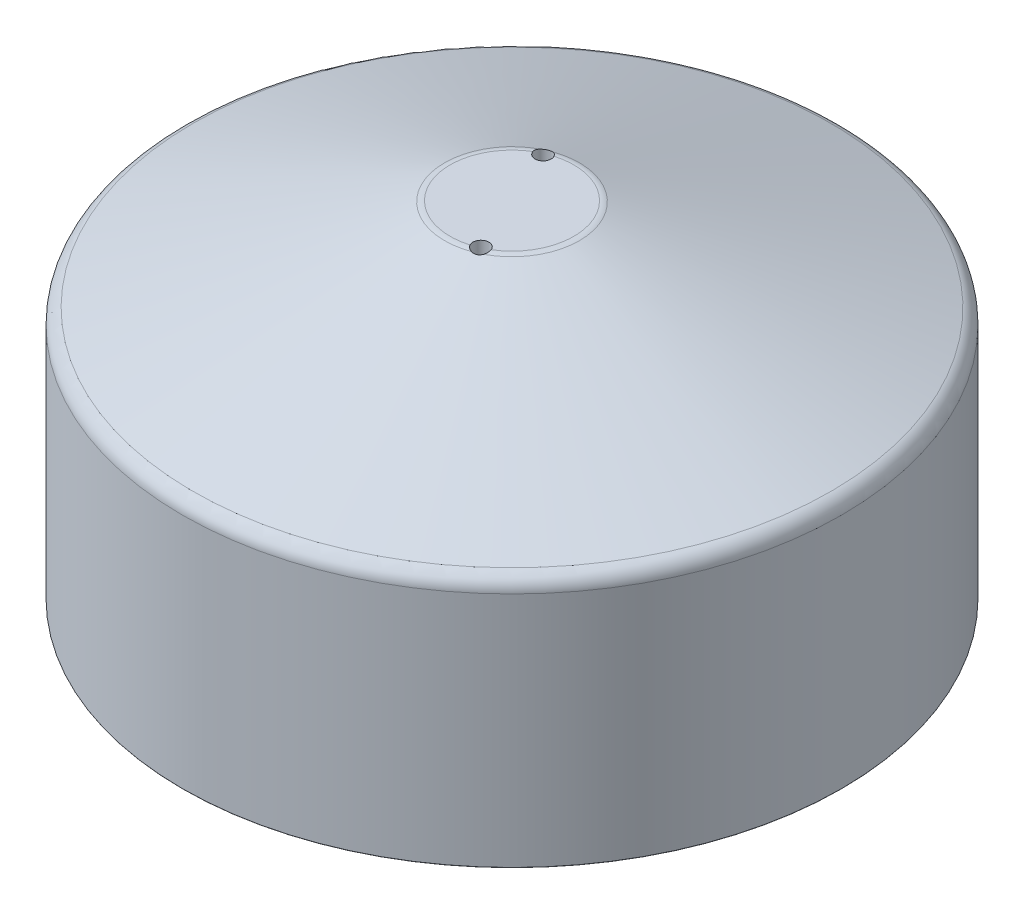
ISO-10303-21;
HEADER;
FILE_DESCRIPTION(('STEP AP214'),'2;1');
FILE_NAME('part.step','',(''),(''),'','','');
FILE_SCHEMA(('AUTOMOTIVE_DESIGN { 1 0 10303 214 1 1 1 1 }'));
ENDSEC;
DATA;
#1=APPLICATION_CONTEXT('core data for automotive mechanical design processes');
#2=APPLICATION_PROTOCOL_DEFINITION('international standard','automotive_design',2000,#1);
#3=PRODUCT_CONTEXT('',#1,'mechanical');
#4=PRODUCT('Part','Part','',(#3));
#5=PRODUCT_RELATED_PRODUCT_CATEGORY('part','',(#4));
#6=PRODUCT_DEFINITION_FORMATION('','',#4);
#7=PRODUCT_DEFINITION_CONTEXT('part definition',#1,'design');
#8=PRODUCT_DEFINITION('design','',#6,#7);
#9=PRODUCT_DEFINITION_SHAPE('','',#8);
#10=(LENGTH_UNIT() NAMED_UNIT(*) SI_UNIT(.MILLI.,.METRE.));
#11=(NAMED_UNIT(*) PLANE_ANGLE_UNIT() SI_UNIT($,.RADIAN.));
#12=(NAMED_UNIT(*) SI_UNIT($,.STERADIAN.) SOLID_ANGLE_UNIT());
#13=UNCERTAINTY_MEASURE_WITH_UNIT(LENGTH_MEASURE(1.E-05),#10,'distance_accuracy_value','');
#14=(GEOMETRIC_REPRESENTATION_CONTEXT(3) GLOBAL_UNCERTAINTY_ASSIGNED_CONTEXT((#13)) GLOBAL_UNIT_ASSIGNED_CONTEXT((#10,
#11,#12)) REPRESENTATION_CONTEXT('',''));
#15=CARTESIAN_POINT('',(0.,0.,0.));
#16=DIRECTION('',(0.,0.,1.));
#17=DIRECTION('',(1.,0.,0.));
#18=AXIS2_PLACEMENT_3D('',#15,#16,#17);
#19=CARTESIAN_POINT('',(0.,24.5121599294206,0.));
#20=DIRECTION('',(0.,-1.,0.));
#21=DIRECTION('',(1.,0.,0.));
#22=AXIS2_PLACEMENT_3D('',#19,#20,#21);
#23=TOROIDAL_SURFACE('',#22,9.7121294690005,2.54);
#24=CARTESIAN_POINT('',(3.16289406880196,26.608133655374,7.64926071069205));
#25=CARTESIAN_POINT('',(3.1122658398592,26.6150586853284,7.68121068737127));
#26=CARTESIAN_POINT('',(3.06443283132598,26.6252204259069,7.71646384288699));
#27=CARTESIAN_POINT('',(2.97505496815367,26.6503008396763,7.79238201545961));
#28=CARTESIAN_POINT('',(2.93348041294001,26.6651959289582,7.8330196312678));
#29=CARTESIAN_POINT('',(2.84531334262754,26.7030655357985,7.9317166127905));
#30=CARTESIAN_POINT('',(2.80095581869567,26.7271233810238,7.9913455828255));
#31=CARTESIAN_POINT('',(2.72343895794779,26.7771996032094,8.11694727354901));
#32=CARTESIAN_POINT('',(2.69031374359375,26.8032236656262,8.18293855600871));
#33=CARTESIAN_POINT('',(2.6359367967409,26.8543258632034,8.31992606584156));
#34=CARTESIAN_POINT('',(2.61467340471618,26.8794049045714,8.39091730093301));
#35=CARTESIAN_POINT('',(2.58480974293635,26.9262135219288,8.53652295254289));
#36=CARTESIAN_POINT('',(2.57619232664354,26.9479475974389,8.61113232112151));
#37=CARTESIAN_POINT('',(2.57253061834088,26.9855881606593,8.76001790083851));
#38=CARTESIAN_POINT('',(2.57712171698754,27.0016377152733,8.834247462846));
#39=CARTESIAN_POINT('',(2.59961137713561,27.0273921163017,8.98179260155693));
#40=CARTESIAN_POINT('',(2.6174999002007,27.0371017384508,9.05510882532504));
#41=CARTESIAN_POINT('',(2.66329949463086,27.0488961840598,9.18909731758884));
#42=CARTESIAN_POINT('',(2.68971198258453,27.0517702072018,9.25021738789718));
#43=CARTESIAN_POINT('',(2.75182788101547,27.0524748955089,9.36755903023198));
#44=CARTESIAN_POINT('',(2.78753003540517,27.0503062421971,9.42378126314098));
#45=CARTESIAN_POINT('',(2.86580846246229,27.0417530555912,9.52797784325945));
#46=CARTESIAN_POINT('',(2.90812456156652,27.035507380779,9.576160388801));
#47=CARTESIAN_POINT('',(2.99923019896101,27.0198456807298,9.66534036899426));
#48=CARTESIAN_POINT('',(3.04802103776636,27.0104290179829,9.70633635630541));
#49=CARTESIAN_POINT('',(3.15416388402147,26.9888119330638,9.78272647730266));
#50=CARTESIAN_POINT('',(3.21186305941604,26.9764725305028,9.81759834694446));
#51=CARTESIAN_POINT('',(3.3318827609153,26.9507450478181,9.87769333545068));
#52=CARTESIAN_POINT('',(3.39420547153777,26.9373564718128,9.90291185821355));
#53=CARTESIAN_POINT('',(3.52657908028919,26.9099867152059,9.94458003131547));
#54=CARTESIAN_POINT('',(3.59686616706889,26.8960288631206,9.96029994087542));
#55=CARTESIAN_POINT('',(3.73946962655608,26.8701473271584,9.97959361524868));
#56=CARTESIAN_POINT('',(3.81178592843163,26.8582235723818,9.98316780349101));
#57=CARTESIAN_POINT('',(3.95580914345715,26.8380322803022,9.97785824840209));
#58=CARTESIAN_POINT('',(4.02751541062143,26.8297314997902,9.9690910351428));
#59=CARTESIAN_POINT('',(4.16872426173695,26.817784186049,9.93933242711084));
#60=CARTESIAN_POINT('',(4.23822846024381,26.814134162091,9.91835021782964));
#61=CARTESIAN_POINT('',(4.3679564638612,26.8120899279083,9.86665001586244));
#62=CARTESIAN_POINT('',(4.42848928555071,26.8133452759574,9.83671746257757));
#63=CARTESIAN_POINT('',(4.54387791072335,26.8201690211535,9.76771128184184));
#64=CARTESIAN_POINT('',(4.59873016405357,26.8257400972547,9.72863198714199));
#65=CARTESIAN_POINT('',(4.70050655451266,26.840389479796,9.64321609131596));
#66=CARTESIAN_POINT('',(4.74753373160007,26.8494159828439,9.59699242818031));
#67=CARTESIAN_POINT('',(4.8335449230131,26.86995433383,9.498211061696));
#68=CARTESIAN_POINT('',(4.87254661964698,26.8814606010361,9.44566769635553));
#69=CARTESIAN_POINT('',(4.91205475828657,26.8953161294943,9.38287689941204));
#70=CARTESIAN_POINT('',(4.91685215505758,26.8970418001206,9.37506440732288));
#71=CARTESIAN_POINT('',(4.95826247360037,26.9123117486965,9.30594883474743));
#72=CARTESIAN_POINT('',(4.9897552854179,26.9265550779419,9.24158186230228));
#73=CARTESIAN_POINT('',(5.04151591053406,26.9547961714071,9.10827588250529));
#74=CARTESIAN_POINT('',(5.06175013740609,26.9687930815164,9.03932387485705));
#75=CARTESIAN_POINT('',(5.09030623101168,26.9948590383268,8.89854596919463));
#76=CARTESIAN_POINT('',(5.0986187971096,27.00692657332,8.82671787226434));
#77=CARTESIAN_POINT('',(5.10281766019221,27.0274935969082,8.68223764287779));
#78=CARTESIAN_POINT('',(5.09871757618119,27.0359969843832,8.60958650062063));
#79=CARTESIAN_POINT('',(5.07843067906742,27.0477766632143,8.46869708555595));
#80=CARTESIAN_POINT('',(5.06276271590201,27.0512589345501,8.40040217652547));
#81=CARTESIAN_POINT('',(5.02031880004396,27.0527521620874,8.26729963497546));
#82=CARTESIAN_POINT('',(4.99354834850747,27.0507658251774,8.20249029333778));
#83=CARTESIAN_POINT('',(4.93228049007016,27.041334343956,8.08315498556849));
#84=CARTESIAN_POINT('',(4.89850511361658,27.0343058193046,8.02822273662619));
#85=CARTESIAN_POINT('',(4.82347070016159,27.0154678346228,7.92463345436288));
#86=CARTESIAN_POINT('',(4.78220949269366,27.0036569867632,7.87597824804763));
#87=CARTESIAN_POINT('',(4.69835273251267,26.9774111744399,7.79082721034411));
#88=CARTESIAN_POINT('',(4.65637267766448,26.963392376732,7.75358732376901));
#89=CARTESIAN_POINT('',(4.5685275946833,26.9327878116325,7.68540734398158));
#90=CARTESIAN_POINT('',(4.52266978634248,26.9162067691012,7.65445589310155));
#91=CARTESIAN_POINT('',(4.47254500622513,26.8977631333309,7.62515524062943));
#92=CARTESIAN_POINT('',(4.46977853346077,26.896744203007,7.6235521766016));
#93=CARTESIAN_POINT('',(4.40825025759456,26.8740615903082,7.58821053835535));
#94=CARTESIAN_POINT('',(4.34704040984042,26.8510742544181,7.55934715316281));
#95=CARTESIAN_POINT('',(4.22097247682139,26.804325473761,7.51171984584249));
#96=CARTESIAN_POINT('',(4.15610444968005,26.7805620013963,7.49298507100336));
#97=CARTESIAN_POINT('',(4.01655926176851,26.7319599192164,7.46456164663566));
#98=CARTESIAN_POINT('',(3.9415741090133,26.707277262744,7.4560519232396));
#99=CARTESIAN_POINT('',(3.78976948882654,26.6631943602675,7.45268681885608));
#100=CARTESIAN_POINT('',(3.71294877318139,26.6437978269233,7.45784100747546));
#101=CARTESIAN_POINT('',(3.63602503419644,26.6288571092347,7.47023915526866));
#102=B_SPLINE_CURVE_WITH_KNOTS('',3,(#24,#25,#26,#27,#28,#29,#30,#31,#32,#33,#34,#35,#36,#37,
#38,#39,#40,#41,#42,#43,#44,#45,#46,#47,#48,#49,#50,#51,#52,#53,#54,#55,#56,#57,#58,#59,#60,#61,
#62,#63,#64,#65,#66,#67,#68,#69,#70,#71,#72,#73,#74,#75,#76,#77,#78,#79,#80,#81,#82,#83,#84,#85,
#86,#87,#88,#89,#90,#91,#92,#93,#94,#95,#96,#97,#98,#99,#100,#101),.UNSPECIFIED.,.F.,.F.,(4,2,2,
2,2,2,2,2,2,2,2,2,2,2,2,2,2,2,2,2,2,2,2,2,2,2,2,2,2,2,2,2,2,2,2,2,2,2,4),(0.,0.180226990449717,
0.359569719874043,0.592703288807219,0.826538875172114,1.06014420704812,1.29343250245942,
1.52034338256523,1.74708313779571,1.94600979417155,2.14490956695911,2.33736556216033,
2.52986027271605,2.73460047676433,2.93943803977046,3.15848664721944,3.37752761802926,
3.59451417639499,3.81133777454986,4.01296453217495,4.21471654841166,4.41355541177789,
4.61195137425204,4.63994011214079,4.8579453931973,5.07659758421792,5.29542026324725,
5.51400293981774,5.72333526108643,5.93256398426677,6.12624466005431,6.31998158226304,
6.49298249115747,6.66566810626562,6.67573592340066,6.88914224543848,7.10315946535491,
7.34001906914286,7.57704460286264),.UNSPECIFIED.);
#103=CARTESIAN_POINT('',(2.72742769422414,27.0521599294206,9.3212980316803));
#104=VERTEX_POINT('',#103);
#105=CARTESIAN_POINT('',(3.58352239252884,26.8989791862168,9.95555016049957));
#106=VERTEX_POINT('',#105);
#107=EDGE_CURVE('E11',#104,#106,#102,.T.);
#108=ORIENTED_EDGE('',*,*,#107,.F.);
#109=CARTESIAN_POINT('',(0.,27.0521599294206,0.));
#110=DIRECTION('',(0.,-1.,0.));
#111=DIRECTION('',(1.,0.,0.));
#112=AXIS2_PLACEMENT_3D('',#109,#110,#111);
#113=CIRCLE('',#112,9.7121294690005);
#114=CARTESIAN_POINT('',(-5.03250478983745,27.0521599294206,-8.30658500004009));
#115=VERTEX_POINT('',#114);
#116=EDGE_CURVE('E94',#115,#104,#113,.F.);
#117=ORIENTED_EDGE('',*,*,#116,.F.);
#118=CARTESIAN_POINT('',(-2.87697142288689,26.6896967395789,-7.89673397754198));
#119=CARTESIAN_POINT('',(-2.85254617629503,26.7008085067653,-7.92532590236226));
#120=CARTESIAN_POINT('',(-2.82952864601568,26.7125184677401,-7.95483190358924));
#121=CARTESIAN_POINT('',(-2.78632742500015,26.7367387693075,-8.01555068256323));
#122=CARTESIAN_POINT('',(-2.76614413771807,26.7492492234819,-8.04676370242721));
#123=CARTESIAN_POINT('',(-2.71015352206755,26.7871987652102,-8.14230707741487));
#124=CARTESIAN_POINT('',(-2.67855283688186,26.8132278072745,-8.20895790385147));
#125=CARTESIAN_POINT('',(-2.64249962788671,26.8489389044264,-8.30607689621396));
#126=CARTESIAN_POINT('',(-2.6330529234166,26.8591724301726,-8.33459554689793));
#127=CARTESIAN_POINT('',(-2.61617658680378,26.8792840637787,-8.3923845517179));
#128=CARTESIAN_POINT('',(-2.6087489957587,26.8891618032951,-8.42165563401126));
#129=CARTESIAN_POINT('',(-2.58855202629045,26.919589238862,-8.51529500972403));
#130=CARTESIAN_POINT('',(-2.57962598078905,26.9391802987529,-8.58086393176486));
#131=CARTESIAN_POINT('',(-2.57220941226128,26.9744788518605,-8.71368651882949));
#132=CARTESIAN_POINT('',(-2.57372717539274,26.9901832511503,-8.78094147940441));
#133=CARTESIAN_POINT('',(-2.58770631464199,27.0166623485027,-8.91560568277111));
#134=CARTESIAN_POINT('',(-2.60021033427651,27.0274175881005,-8.98301450477241));
#135=CARTESIAN_POINT('',(-2.63623598784003,27.0432867140547,-9.11549453416932));
#136=CARTESIAN_POINT('',(-2.65975152388752,27.0484037174625,-9.18056701392175));
#137=CARTESIAN_POINT('',(-2.71536069186164,27.0528744431317,-9.30214455607767));
#138=CARTESIAN_POINT('',(-2.74681458431902,27.0525735934964,-9.35893126645707));
#139=CARTESIAN_POINT('',(-2.81793111485512,27.0475362074729,-9.46687953639351));
#140=CARTESIAN_POINT('',(-2.8575944986402,27.0427992679962,-9.5180405842985));
#141=CARTESIAN_POINT('',(-2.94419923947084,27.0296820136994,-9.61371466254003));
#142=CARTESIAN_POINT('',(-2.99117849284788,27.0212822928954,-9.65819056245734));
#143=CARTESIAN_POINT('',(-3.09103382919563,27.0018820120861,-9.7392680652243));
#144=CARTESIAN_POINT('',(-3.14391275787356,26.9908801940696,-9.77586584291399));
#145=CARTESIAN_POINT('',(-3.25888205149332,26.9664589907201,-9.84317960203291));
#146=CARTESIAN_POINT('',(-3.32137217046041,26.9529153703554,-9.87316775921204));
#147=CARTESIAN_POINT('',(-3.45034940054869,26.9256251379457,-9.92253556451388));
#148=CARTESIAN_POINT('',(-3.51683502467277,26.9118786028383,-9.94191913251471));
#149=CARTESIAN_POINT('',(-3.63829679177626,26.8883839874752,-9.96674694074689));
#150=CARTESIAN_POINT('',(-3.6928155339719,26.8783963055081,-9.9742427254646));
#151=CARTESIAN_POINT('',(-3.8026022374595,26.8599504333767,-9.98206938858203));
#152=CARTESIAN_POINT('',(-3.85786968679093,26.8514912496868,-9.98240493787454));
#153=CARTESIAN_POINT('',(-3.96717974118913,26.8368927403937,-9.97586452723816));
#154=CARTESIAN_POINT('',(-4.02122501409002,26.8307109697308,-9.96913060085904));
#155=CARTESIAN_POINT('',(-4.12824038690555,26.8209237367184,-9.94868744807839));
#156=CARTESIAN_POINT('',(-4.18121008498089,26.8173192206407,-9.93497566282676));
#157=CARTESIAN_POINT('',(-4.29680571427525,26.8125146142302,-9.89687285666289));
#158=CARTESIAN_POINT('',(-4.35890772388755,26.8120422401095,-9.8707684364456));
#159=CARTESIAN_POINT('',(-4.47809104389162,26.8155200789922,-9.80908083997495));
#160=CARTESIAN_POINT('',(-4.53516991379465,26.8194724290887,-9.77349308970549));
#161=CARTESIAN_POINT('',(-4.64259403164042,26.8312825023068,-9.69405567419189));
#162=CARTESIAN_POINT('',(-4.69295293890902,26.8391321453109,-9.65022321870115));
#163=CARTESIAN_POINT('',(-4.78589941944532,26.8578049740712,-9.55553301722893));
#164=CARTESIAN_POINT('',(-4.82848529085663,26.8686288097112,-9.50467373704148));
#165=CARTESIAN_POINT('',(-4.90648128113842,26.8925211797468,-9.3952005625832));
#166=CARTESIAN_POINT('',(-4.94156143989889,26.9056588050114,-9.33636701823583));
#167=CARTESIAN_POINT('',(-5.00175961090195,26.932459136049,-9.21390345320129));
#168=CARTESIAN_POINT('',(-5.02687404954971,26.9461220282538,-9.15027172165426));
#169=CARTESIAN_POINT('',(-5.06769971236741,26.9732830567372,-9.01584387821304));
#170=CARTESIAN_POINT('',(-5.08278867850721,26.9867267528743,-8.94484617953357));
#171=CARTESIAN_POINT('',(-5.10059918515102,27.0108888659197,-8.80084664525856));
#172=CARTESIAN_POINT('',(-5.10332280573245,27.0216077409063,-8.72784514881723));
#173=CARTESIAN_POINT('',(-5.09616262507979,27.038498638995,-8.58401332472436));
#174=CARTESIAN_POINT('',(-5.08663470457496,27.0447911557226,-8.51318022020389));
#175=CARTESIAN_POINT('',(-5.05566816564245,27.0521091620587,-8.37389069197885));
#176=CARTESIAN_POINT('',(-5.03423696942189,27.0531379297644,-8.30543281545071));
#177=CARTESIAN_POINT('',(-4.98235609454452,27.0493763410238,-8.17856936687842));
#178=CARTESIAN_POINT('',(-4.95276418677102,27.0450445363247,-8.11979767842969));
#179=CARTESIAN_POINT('',(-4.88517299668716,27.0312684452675,-8.00800830556993));
#180=CARTESIAN_POINT('',(-4.84717732409292,27.0218263514483,-7.95498816519419));
#181=CARTESIAN_POINT('',(-4.76502777384774,26.9985324340436,-7.85707125155707));
#182=CARTESIAN_POINT('',(-4.72102309104493,26.9847793081944,-7.81202491275399));
#183=CARTESIAN_POINT('',(-4.62754415524223,26.9536076765156,-7.7294236613989));
#184=CARTESIAN_POINT('',(-4.57806211081979,26.9361839166533,-7.69187963916583));
#185=CARTESIAN_POINT('',(-4.47040783956134,26.8971489521522,-7.62188032673527));
#186=CARTESIAN_POINT('',(-4.41185425623818,26.8753066846312,-7.59013849368924));
#187=CARTESIAN_POINT('',(-4.32133666624278,26.8415680974881,-7.54984491497055));
#188=CARTESIAN_POINT('',(-4.29075241394575,26.8301728239521,-7.5376432751884));
#189=CARTESIAN_POINT('',(-4.22877214386344,26.8072796843423,-7.51567777420769));
#190=CARTESIAN_POINT('',(-4.1973764335406,26.7957818581766,-7.50591300419672));
#191=CARTESIAN_POINT('',(-4.16561479444639,26.7843430899392,-7.49737166477614));
#192=B_SPLINE_CURVE_WITH_KNOTS('',3,(#118,#119,#120,#121,#122,#123,#124,#125,#126,#127,#128,
#129,#130,#131,#132,#133,#134,#135,#136,#137,#138,#139,#140,#141,#142,#143,#144,#145,#146,#147,
#148,#149,#150,#151,#152,#153,#154,#155,#156,#157,#158,#159,#160,#161,#162,#163,#164,#165,#166,
#167,#168,#169,#170,#171,#172,#173,#174,#175,#176,#177,#178,#179,#180,#181,#182,#183,#184,#185,
#186,#187,#188,#189,#190,#191),.UNSPECIFIED.,.F.,.F.,(4,2,2,2,2,2,2,2,2,2,2,2,2,2,2,2,2,2,2,2,2,
2,2,2,2,2,2,2,2,2,2,2,2,2,2,2,4),(0.,0.117521351666716,0.235059415559967,0.468440583554988,
0.563600402055579,0.658856061746532,0.864969856843791,1.07124720226144,1.2783287748003,
1.48529580650772,1.67911667603697,1.87295515895173,2.06783334898588,2.26280594821767,
2.47375700490775,2.68463003291838,2.85197084654004,3.01920249407081,3.18313742366368,
3.34713251318876,3.54819910077948,3.74936284323731,3.95011125087141,4.15090355849853,
4.35924460461631,4.56766029211703,4.7880350954987,5.00837282643145,5.22245249314484,
5.43639882154709,5.63324435371757,5.83000549736488,6.02255573107675,6.21538347100486,
6.42476349490202,6.52921721549424,6.63363192243867),.UNSPECIFIED.);
#193=CARTESIAN_POINT('',(-4.92210565094648,26.8989791862168,-9.36629530267433));
#194=VERTEX_POINT('',#193);
#195=EDGE_CURVE('E77',#194,#115,#192,.T.);
#196=ORIENTED_EDGE('',*,*,#195,.F.);
#197=CARTESIAN_POINT('',(0.,26.8989791862168,0.));
#198=DIRECTION('',(0.,1.,0.));
#199=DIRECTION('',(-1.,0.,0.));
#200=AXIS2_PLACEMENT_3D('',#197,#198,#199);
#201=CIRCLE('',#200,10.5808606330477);
#202=EDGE_CURVE('E218',#106,#194,#201,.F.);
#203=ORIENTED_EDGE('',*,*,#202,.F.);
#204=EDGE_LOOP('',(#108,#117,#196,#203));
#205=FACE_BOUND('',#204,.T.);
#206=ADVANCED_FACE('F35',(#205),#23,.T.);
#207=CARTESIAN_POINT('',(0.,27.0521599294206,0.));
#208=DIRECTION('',(0.,1.,0.));
#209=DIRECTION('',(-1.,0.,0.));
#210=AXIS2_PLACEMENT_3D('',#207,#208,#209);
#211=CYLINDRICAL_SURFACE('',#210,50.8);
#212=CARTESIAN_POINT('',(0.,-27.0521599294206,0.));
#213=DIRECTION('',(0.,1.,0.));
#214=DIRECTION('',(-1.,0.,0.));
#215=AXIS2_PLACEMENT_3D('',#212,#213,#214);
#216=CIRCLE('',#215,50.8);
#217=CARTESIAN_POINT('',(-50.8,-27.0521599294206,0.));
#218=VERTEX_POINT('',#217);
#219=EDGE_CURVE('E219',#218,#218,#216,.T.);
#220=ORIENTED_EDGE('',*,*,#219,.F.);
#221=EDGE_LOOP('',(#220));
#222=FACE_BOUND('',#221,.T.);
#223=CARTESIAN_POINT('',(0.,11.0478400705794,0.));
#224=DIRECTION('',(0.,1.,0.));
#225=DIRECTION('',(-1.,0.,0.));
#226=AXIS2_PLACEMENT_3D('',#223,#224,#225);
#227=CIRCLE('',#226,50.8);
#228=CARTESIAN_POINT('',(-50.8,11.0478400705794,0.));
#229=VERTEX_POINT('',#228);
#230=EDGE_CURVE('E223',#229,#229,#227,.T.);
#231=ORIENTED_EDGE('',*,*,#230,.T.);
#232=EDGE_LOOP('',(#231));
#233=FACE_BOUND('',#232,.T.);
#234=ADVANCED_FACE('F153',(#222,#233),#211,.F.);
#235=CARTESIAN_POINT('',(50.8,-27.0521599294206,0.));
#236=DIRECTION('',(0.,1.,0.));
#237=DIRECTION('',(-1.,0.,0.));
#238=AXIS2_PLACEMENT_3D('',#235,#236,#237);
#239=PLANE('',#238);
#240=CARTESIAN_POINT('',(0.,-27.0521599294206,0.));
#241=DIRECTION('',(0.,1.,0.));
#242=DIRECTION('',(-1.,0.,0.));
#243=AXIS2_PLACEMENT_3D('',#240,#241,#242);
#244=CIRCLE('',#243,51.6255);
#245=CARTESIAN_POINT('',(-51.6255,-27.0521599294206,0.));
#246=VERTEX_POINT('',#245);
#247=EDGE_CURVE('E88',#246,#246,#244,.F.);
#248=ORIENTED_EDGE('',*,*,#247,.T.);
#249=EDGE_LOOP('',(#248));
#250=FACE_BOUND('',#249,.T.);
#251=ORIENTED_EDGE('',*,*,#219,.T.);
#252=EDGE_LOOP('',(#251));
#253=FACE_BOUND('',#252,.T.);
#254=ADVANCED_FACE('F149',(#250,#253),#239,.F.);
#255=CARTESIAN_POINT('',(0.,27.0521599294206,0.));
#256=DIRECTION('',(0.,1.,0.));
#257=DIRECTION('',(-1.,0.,0.));
#258=AXIS2_PLACEMENT_3D('',#255,#256,#257);
#259=CYLINDRICAL_SURFACE('',#258,51.689);
#260=CARTESIAN_POINT('',(0.,-26.9886599294206,0.));
#261=DIRECTION('',(0.,1.,0.));
#262=DIRECTION('',(-1.,0.,0.));
#263=AXIS2_PLACEMENT_3D('',#260,#261,#262);
#264=CIRCLE('',#263,51.689);
#265=CARTESIAN_POINT('',(-51.689,-26.9886599294206,0.));
#266=VERTEX_POINT('',#265);
#267=EDGE_CURVE('E101',#266,#266,#264,.T.);
#268=ORIENTED_EDGE('',*,*,#267,.T.);
#269=EDGE_LOOP('',(#268));
#270=FACE_BOUND('',#269,.T.);
#271=CARTESIAN_POINT('',(0.,10.1583129235267,0.));
#272=DIRECTION('',(0.,-1.,0.));
#273=DIRECTION('',(1.,0.,0.));
#274=AXIS2_PLACEMENT_3D('',#271,#272,#273);
#275=CIRCLE('',#274,51.689);
#276=CARTESIAN_POINT('',(51.689,10.1583129235267,0.));
#277=VERTEX_POINT('',#276);
#278=EDGE_CURVE('E105',#277,#277,#275,.T.);
#279=ORIENTED_EDGE('',*,*,#278,.T.);
#280=EDGE_LOOP('',(#279));
#281=FACE_BOUND('',#280,.T.);
#282=ADVANCED_FACE('F144',(#270,#281),#259,.T.);
#283=CARTESIAN_POINT('',(0.,11.9368400705794,0.));
#284=DIRECTION('',(0.,-1.,0.));
#285=DIRECTION('',(1.,0.,0.));
#286=AXIS2_PLACEMENT_3D('',#283,#284,#285);
#287=CONICAL_SURFACE('',#286,51.689,1.22173047639603);
#288=CARTESIAN_POINT('',(0.,12.545132180323,0.));
#289=DIRECTION('',(0.,1.,0.));
#290=DIRECTION('',(-1.,0.,0.));
#291=AXIS2_PLACEMENT_3D('',#288,#289,#290);
#292=CIRCLE('',#291,50.0177311640472);
#293=CARTESIAN_POINT('',(-50.0177311640472,12.545132180323,0.));
#294=VERTEX_POINT('',#293);
#295=EDGE_CURVE('E221',#294,#294,#292,.T.);
#296=ORIENTED_EDGE('',*,*,#295,.T.);
#297=EDGE_LOOP('',(#296));
#298=FACE_BOUND('',#297,.T.);
#299=CARTESIAN_POINT('',(-3.58352239252894,26.8989791862168,-9.95555016049953));
#300=VERTEX_POINT('',#299);
#301=CARTESIAN_POINT('',(4.92210565094617,26.8989791862168,9.36629530267449));
#302=VERTEX_POINT('',#301);
#303=EDGE_CURVE('E216',#300,#302,#201,.F.);
#304=ORIENTED_EDGE('',*,*,#303,.T.);
#305=CARTESIAN_POINT('',(4.92264633216075,26.8991791862168,9.36539037393108));
#306=CARTESIAN_POINT('',(4.90527222381212,26.8927441155854,9.39449660927808));
#307=CARTESIAN_POINT('',(4.88669754676391,26.8866789103385,9.42295116871466));
#308=CARTESIAN_POINT('',(4.84723403313602,26.8753207859461,9.47837565165465));
#309=CARTESIAN_POINT('',(4.82634490581782,26.8700279640205,9.50534538799791));
#310=CARTESIAN_POINT('',(4.7603662247568,26.8553642919651,9.5837174528993));
#311=CARTESIAN_POINT('',(4.71194713713617,26.8472014820964,9.63261325571554));
#312=CARTESIAN_POINT('',(4.60749356319505,26.834346558754,9.72210901663499));
#313=CARTESIAN_POINT('',(4.55144963953629,26.8296587934913,9.76269853555883));
#314=CARTESIAN_POINT('',(4.4333845478972,26.8239028438883,9.83422561898091));
#315=CARTESIAN_POINT('',(4.37136812504745,26.8228318100732,9.86517076442944));
#316=CARTESIAN_POINT('',(4.24425486301104,26.824321340395,9.91606276999956));
#317=CARTESIAN_POINT('',(4.17922855213386,26.8268203117536,9.93618811463414));
#318=CARTESIAN_POINT('',(4.04696568325135,26.8352709527897,9.96573432102867));
#319=CARTESIAN_POINT('',(3.97972816400199,26.8412241432932,9.97515046232415));
#320=CARTESIAN_POINT('',(3.85684398952349,26.8550808454584,9.98243565034934));
#321=CARTESIAN_POINT('',(3.80123186197289,26.8624594593468,9.98203967539374));
#322=CARTESIAN_POINT('',(3.69094044358189,26.8792960114865,9.97403886508242));
#323=CARTESIAN_POINT('',(3.63625975766513,26.888750478255,9.96644599571639));
#324=CARTESIAN_POINT('',(3.5824898598688,26.8991791862168,9.95533777285301));
#325=B_SPLINE_CURVE_WITH_KNOTS('',3,(#305,#306,#307,#308,#309,#310,#311,#312,#313,#314,#315,
#316,#317,#318,#319,#320,#321,#322,#323,#324),.UNSPECIFIED.,.F.,.F.,(4,2,2,2,2,2,2,2,2,4),(0.,
0.103449763245792,0.206912536494715,0.41373062082149,0.620807055130579,0.827720304267493,
1.03110652364342,1.23458235806821,1.40238563355677,1.5699103977257),.UNSPECIFIED.);
#326=EDGE_CURVE('E54',#302,#106,#325,.T.);
#327=ORIENTED_EDGE('',*,*,#326,.T.);
#328=ORIENTED_EDGE('',*,*,#202,.T.);
#329=CARTESIAN_POINT('',(-4.92264633216105,26.8991791862168,-9.36539037393092));
#330=CARTESIAN_POINT('',(-4.90527222381244,26.8927441155854,-9.39449660927792));
#331=CARTESIAN_POINT('',(-4.88669754676423,26.8866789103385,-9.4229511687145));
#332=CARTESIAN_POINT('',(-4.84723403313635,26.8753207859461,-9.4783756516545));
#333=CARTESIAN_POINT('',(-4.82634490581815,26.8700279640205,-9.50534538799776));
#334=CARTESIAN_POINT('',(-4.76036622475714,26.8553642919651,-9.58371745289916));
#335=CARTESIAN_POINT('',(-4.71194713713651,26.8472014820964,-9.63261325571541));
#336=CARTESIAN_POINT('',(-4.6074935631954,26.834346558754,-9.72210901663488));
#337=CARTESIAN_POINT('',(-4.55144963953665,26.8296587934913,-9.76269853555873));
#338=CARTESIAN_POINT('',(-4.43338454789757,26.8239028438883,-9.83422561898082));
#339=CARTESIAN_POINT('',(-4.37136812504782,26.8228318100732,-9.86517076442935));
#340=CARTESIAN_POINT('',(-4.24425486301142,26.8243213403949,-9.91606276999949));
#341=CARTESIAN_POINT('',(-4.17922855213423,26.8268203117536,-9.93618811463408));
#342=CARTESIAN_POINT('',(-4.04696568325173,26.8352709527897,-9.96573432102863));
#343=CARTESIAN_POINT('',(-3.97972816400237,26.8412241432932,-9.97515046232412));
#344=CARTESIAN_POINT('',(-3.85684398952383,26.8550808454583,-9.98243565034933));
#345=CARTESIAN_POINT('',(-3.80123186197317,26.8624594593467,-9.98203967539373));
#346=CARTESIAN_POINT('',(-3.69094044358208,26.8792960114865,-9.97403886508241));
#347=CARTESIAN_POINT('',(-3.63625975766527,26.8887504782549,-9.96644599571638));
#348=CARTESIAN_POINT('',(-3.5824898598689,26.8991791862168,-9.95533777285297));
#349=B_SPLINE_CURVE_WITH_KNOTS('',3,(#329,#330,#331,#332,#333,#334,#335,#336,#337,#338,#339,
#340,#341,#342,#343,#344,#345,#346,#347,#348),.UNSPECIFIED.,.F.,.F.,(4,2,2,2,2,2,2,2,2,4),(0.,
0.10344976324579,0.206912536494716,0.413730620821495,0.620807055130589,0.827720304267504,
1.03110652364343,1.23458235806823,1.40238563355693,1.56991039772601),.UNSPECIFIED.);
#350=EDGE_CURVE('E62',#194,#300,#349,.T.);
#351=ORIENTED_EDGE('',*,*,#350,.T.);
#352=EDGE_LOOP('',(#304,#327,#328,#351));
#353=FACE_BOUND('',#352,.T.);
#354=ADVANCED_FACE('F140',(#298,#353),#287,.T.);
#355=CARTESIAN_POINT('',(10.16,27.0521599294206,0.));
#356=DIRECTION('',(0.,-1.,0.));
#357=DIRECTION('',(1.,0.,0.));
#358=AXIS2_PLACEMENT_3D('',#355,#356,#357);
#359=PLANE('',#358);
#360=ORIENTED_EDGE('',*,*,#116,.T.);
#361=CARTESIAN_POINT('',(3.83760331650919,27.0521599294206,8.71770759919814));
#362=DIRECTION('',(0.,-1.,0.));
#363=DIRECTION('',(1.,0.,0.));
#364=AXIS2_PLACEMENT_3D('',#361,#362,#363);
#365=CIRCLE('',#364,1.26365);
#366=CARTESIAN_POINT('',(5.03250478983727,27.0521599294206,8.3065850000402));
#367=VERTEX_POINT('',#366);
#368=EDGE_CURVE('E134',#104,#367,#365,.T.);
#369=ORIENTED_EDGE('',*,*,#368,.T.);
#370=CARTESIAN_POINT('',(-2.72742769422434,27.0521599294206,-9.32129803168024));
#371=VERTEX_POINT('',#370);
#372=EDGE_CURVE('E96',#367,#371,#113,.F.);
#373=ORIENTED_EDGE('',*,*,#372,.T.);
#374=CARTESIAN_POINT('',(-3.83760331650941,27.0521599294206,-8.71770759919813));
#375=DIRECTION('',(0.,-1.,0.));
#376=DIRECTION('',(1.,0.,0.));
#377=AXIS2_PLACEMENT_3D('',#374,#375,#376);
#378=CIRCLE('',#377,1.26365);
#379=EDGE_CURVE('E81',#371,#115,#378,.T.);
#380=ORIENTED_EDGE('',*,*,#379,.T.);
#381=EDGE_LOOP('',(#360,#369,#373,#380));
#382=FACE_BOUND('',#381,.T.);
#383=ADVANCED_FACE('F92',(#382),#359,.F.);
#384=CARTESIAN_POINT('',(50.8,11.0478400705794,0.));
#385=DIRECTION('',(0.,1.,0.));
#386=DIRECTION('',(-1.,0.,0.));
#387=AXIS2_PLACEMENT_3D('',#384,#385,#386);
#388=PLANE('',#387);
#389=CARTESIAN_POINT('',(3.83760331650919,11.0478400705794,8.71770759919814));
#390=DIRECTION('',(0.,-1.,0.));
#391=DIRECTION('',(1.,0.,0.));
#392=AXIS2_PLACEMENT_3D('',#389,#390,#391);
#393=CIRCLE('',#392,1.26365);
#394=CARTESIAN_POINT('',(5.10125331650919,11.0478400705794,8.71770759919814));
#395=VERTEX_POINT('',#394);
#396=EDGE_CURVE('E97',#395,#395,#393,.T.);
#397=ORIENTED_EDGE('',*,*,#396,.F.);
#398=EDGE_LOOP('',(#397));
#399=FACE_BOUND('',#398,.T.);
#400=CARTESIAN_POINT('',(-3.83760331650941,11.0478400705794,-8.71770759919813));
#401=DIRECTION('',(0.,-1.,0.));
#402=DIRECTION('',(1.,0.,0.));
#403=AXIS2_PLACEMENT_3D('',#400,#401,#402);
#404=CIRCLE('',#403,1.26365);
#405=CARTESIAN_POINT('',(-2.57395331650941,11.0478400705794,-8.71770759919813));
#406=VERTEX_POINT('',#405);
#407=EDGE_CURVE('E98',#406,#406,#404,.T.);
#408=ORIENTED_EDGE('',*,*,#407,.F.);
#409=EDGE_LOOP('',(#408));
#410=FACE_BOUND('',#409,.T.);
#411=ORIENTED_EDGE('',*,*,#230,.F.);
#412=EDGE_LOOP('',(#411));
#413=FACE_BOUND('',#412,.T.);
#414=ADVANCED_FACE('F123',(#399,#410,#413),#388,.F.);
#415=CARTESIAN_POINT('',(0.,10.1583129235267,0.));
#416=DIRECTION('',(0.,-1.,0.));
#417=DIRECTION('',(1.,0.,0.));
#418=AXIS2_PLACEMENT_3D('',#415,#416,#417);
#419=TOROIDAL_SURFACE('',#418,49.149,2.54);
#420=ORIENTED_EDGE('',*,*,#278,.F.);
#421=EDGE_LOOP('',(#420));
#422=FACE_BOUND('',#421,.T.);
#423=ORIENTED_EDGE('',*,*,#295,.F.);
#424=EDGE_LOOP('',(#423));
#425=FACE_BOUND('',#424,.T.);
#426=ADVANCED_FACE('F157',(#422,#425),#419,.T.);
#427=EDGE_CURVE('E39',#302,#367,#102,.T.);
#428=ORIENTED_EDGE('',*,*,#427,.F.);
#429=ORIENTED_EDGE('',*,*,#303,.F.);
#430=EDGE_CURVE('E87',#371,#300,#192,.T.);
#431=ORIENTED_EDGE('',*,*,#430,.F.);
#432=ORIENTED_EDGE('',*,*,#372,.F.);
#433=EDGE_LOOP('',(#428,#429,#431,#432));
#434=FACE_BOUND('',#433,.T.);
#435=ADVANCED_FACE('F115',(#434),#23,.T.);
#436=CARTESIAN_POINT('',(0.,-26.9886599294206,0.));
#437=DIRECTION('',(0.,1.,0.));
#438=DIRECTION('',(-1.,0.,0.));
#439=AXIS2_PLACEMENT_3D('',#436,#437,#438);
#440=TOROIDAL_SURFACE('',#439,51.6255,0.0635);
#441=ORIENTED_EDGE('',*,*,#247,.F.);
#442=EDGE_LOOP('',(#441));
#443=FACE_BOUND('',#442,.T.);
#444=ORIENTED_EDGE('',*,*,#267,.F.);
#445=EDGE_LOOP('',(#444));
#446=FACE_BOUND('',#445,.T.);
#447=ADVANCED_FACE('F37',(#443,#446),#440,.T.);
#448=CARTESIAN_POINT('',(-3.83760331650941,27.0521599294206,-8.71770759919813));
#449=DIRECTION('',(0.,-1.,0.));
#450=DIRECTION('',(1.,0.,0.));
#451=AXIS2_PLACEMENT_3D('',#448,#449,#450);
#452=CYLINDRICAL_SURFACE('',#451,1.26365);
#453=ORIENTED_EDGE('',*,*,#430,.T.);
#454=ORIENTED_EDGE('',*,*,#350,.F.);
#455=ORIENTED_EDGE('',*,*,#195,.T.);
#456=ORIENTED_EDGE('',*,*,#379,.F.);
#457=EDGE_LOOP('',(#453,#454,#455,#456));
#458=FACE_BOUND('',#457,.T.);
#459=ORIENTED_EDGE('',*,*,#407,.T.);
#460=EDGE_LOOP('',(#459));
#461=FACE_BOUND('',#460,.T.);
#462=ADVANCED_FACE('F79',(#458,#461),#452,.F.);
#463=CARTESIAN_POINT('',(3.83760331650919,27.0521599294206,8.71770759919814));
#464=DIRECTION('',(0.,-1.,0.));
#465=DIRECTION('',(1.,0.,0.));
#466=AXIS2_PLACEMENT_3D('',#463,#464,#465);
#467=CYLINDRICAL_SURFACE('',#466,1.26365);
#468=ORIENTED_EDGE('',*,*,#107,.T.);
#469=ORIENTED_EDGE('',*,*,#326,.F.);
#470=ORIENTED_EDGE('',*,*,#427,.T.);
#471=ORIENTED_EDGE('',*,*,#368,.F.);
#472=EDGE_LOOP('',(#468,#469,#470,#471));
#473=FACE_BOUND('',#472,.T.);
#474=ORIENTED_EDGE('',*,*,#396,.T.);
#475=EDGE_LOOP('',(#474));
#476=FACE_BOUND('',#475,.T.);
#477=ADVANCED_FACE('F121',(#473,#476),#467,.F.);
#478=CLOSED_SHELL('',(#206,#234,#254,#282,#354,#383,#414,#426,#435,#447,#462,#477));
#479=MANIFOLD_SOLID_BREP('B2',#478);
#480=ADVANCED_BREP_SHAPE_REPRESENTATION('',(#18,#479),#14);
#481=SHAPE_DEFINITION_REPRESENTATION(#9,#480);
ENDSEC;
END-ISO-10303-21;
